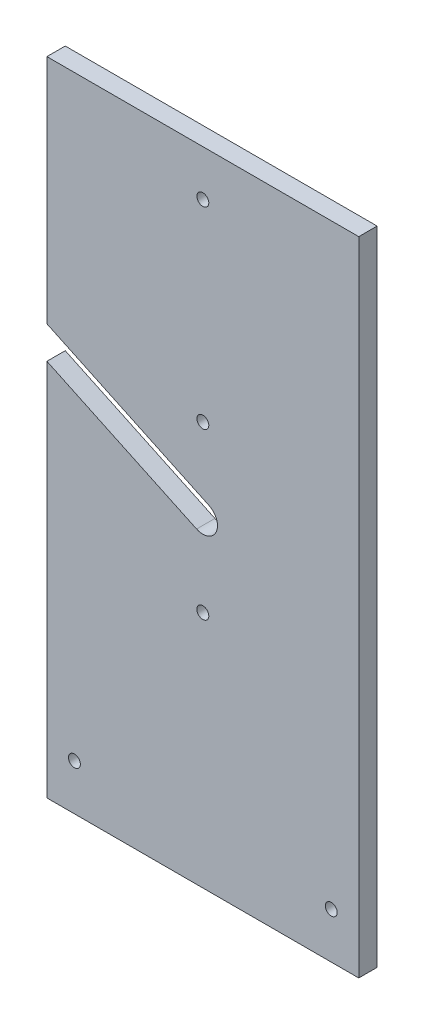
ISO-10303-21;
HEADER;
FILE_DESCRIPTION(('STEP AP214'),'2;1');
FILE_NAME('part.step','',(''),(''),'','','');
FILE_SCHEMA(('AUTOMOTIVE_DESIGN { 1 0 10303 214 1 1 1 1 }'));
ENDSEC;
DATA;
#1=APPLICATION_CONTEXT('core data for automotive mechanical design processes');
#2=APPLICATION_PROTOCOL_DEFINITION('international standard','automotive_design',2000,#1);
#3=PRODUCT_CONTEXT('',#1,'mechanical');
#4=PRODUCT('Part','Part','',(#3));
#5=PRODUCT_RELATED_PRODUCT_CATEGORY('part','',(#4));
#6=PRODUCT_DEFINITION_FORMATION('','',#4);
#7=PRODUCT_DEFINITION_CONTEXT('part definition',#1,'design');
#8=PRODUCT_DEFINITION('design','',#6,#7);
#9=PRODUCT_DEFINITION_SHAPE('','',#8);
#10=(LENGTH_UNIT() NAMED_UNIT(*) SI_UNIT(.MILLI.,.METRE.));
#11=(NAMED_UNIT(*) PLANE_ANGLE_UNIT() SI_UNIT($,.RADIAN.));
#12=(NAMED_UNIT(*) SI_UNIT($,.STERADIAN.) SOLID_ANGLE_UNIT());
#13=UNCERTAINTY_MEASURE_WITH_UNIT(LENGTH_MEASURE(1.E-05),#10,'distance_accuracy_value','');
#14=(GEOMETRIC_REPRESENTATION_CONTEXT(3) GLOBAL_UNCERTAINTY_ASSIGNED_CONTEXT((#13)) GLOBAL_UNIT_ASSIGNED_CONTEXT((#10,
#11,#12)) REPRESENTATION_CONTEXT('',''));
#15=CARTESIAN_POINT('',(0.,0.,0.));
#16=DIRECTION('',(0.,0.,1.));
#17=DIRECTION('',(1.,0.,0.));
#18=AXIS2_PLACEMENT_3D('',#15,#16,#17);
#19=CARTESIAN_POINT('',(85.,175.,10.));
#20=DIRECTION('',(0.,-1.,0.));
#21=DIRECTION('',(1.,0.,0.));
#22=AXIS2_PLACEMENT_3D('',#19,#20,#21);
#23=PLANE('',#22);
#24=DIRECTION('',(-1.,0.,0.));
#25=VECTOR('',#24,1.);
#26=CARTESIAN_POINT('',(85.,175.,0.));
#27=LINE('',#26,#25);
#28=CARTESIAN_POINT('',(85.,175.,0.));
#29=VERTEX_POINT('',#28);
#30=CARTESIAN_POINT('',(-85.,175.,0.));
#31=VERTEX_POINT('',#30);
#32=EDGE_CURVE('E142',#29,#31,#27,.T.);
#33=ORIENTED_EDGE('',*,*,#32,.T.);
#34=DIRECTION('',(0.,0.,-1.));
#35=VECTOR('',#34,1.);
#36=CARTESIAN_POINT('',(-85.,175.,10.));
#37=LINE('',#36,#35);
#38=CARTESIAN_POINT('',(-85.,175.,10.));
#39=VERTEX_POINT('',#38);
#40=EDGE_CURVE('E11',#39,#31,#37,.T.);
#41=ORIENTED_EDGE('',*,*,#40,.F.);
#42=DIRECTION('',(-1.,0.,0.));
#43=VECTOR('',#42,1.);
#44=CARTESIAN_POINT('',(85.,175.,10.));
#45=LINE('',#44,#43);
#46=CARTESIAN_POINT('',(85.,175.,10.));
#47=VERTEX_POINT('',#46);
#48=EDGE_CURVE('E170',#47,#39,#45,.T.);
#49=ORIENTED_EDGE('',*,*,#48,.F.);
#50=DIRECTION('',(0.,0.,-1.));
#51=VECTOR('',#50,1.);
#52=CARTESIAN_POINT('',(85.,175.,10.));
#53=LINE('',#52,#51);
#54=EDGE_CURVE('E56',#47,#29,#53,.T.);
#55=ORIENTED_EDGE('',*,*,#54,.T.);
#56=EDGE_LOOP('',(#33,#41,#49,#55));
#57=FACE_BOUND('',#56,.T.);
#58=ADVANCED_FACE('F39',(#57),#23,.F.);
#59=CARTESIAN_POINT('',(-85.,175.,10.));
#60=DIRECTION('',(1.,0.,0.));
#61=DIRECTION('',(0.,1.,0.));
#62=AXIS2_PLACEMENT_3D('',#59,#60,#61);
#63=PLANE('',#62);
#64=DIRECTION('',(0.,-1.,0.));
#65=VECTOR('',#64,1.);
#66=CARTESIAN_POINT('',(-85.,175.,0.));
#67=LINE('',#66,#65);
#68=CARTESIAN_POINT('',(-85.,48.8415502249675,0.));
#69=VERTEX_POINT('',#68);
#70=EDGE_CURVE('E145',#31,#69,#67,.T.);
#71=ORIENTED_EDGE('',*,*,#70,.T.);
#72=DIRECTION('',(0.,0.,-1.));
#73=VECTOR('',#72,1.);
#74=CARTESIAN_POINT('',(-85.,48.8415502249675,10.));
#75=LINE('',#74,#73);
#76=CARTESIAN_POINT('',(-85.,48.8415502249675,10.));
#77=VERTEX_POINT('',#76);
#78=EDGE_CURVE('E48',#77,#69,#75,.T.);
#79=ORIENTED_EDGE('',*,*,#78,.F.);
#80=DIRECTION('',(0.,-1.,0.));
#81=VECTOR('',#80,1.);
#82=CARTESIAN_POINT('',(-85.,175.,10.));
#83=LINE('',#82,#81);
#84=EDGE_CURVE('E94',#39,#77,#83,.T.);
#85=ORIENTED_EDGE('',*,*,#84,.F.);
#86=ORIENTED_EDGE('',*,*,#40,.T.);
#87=EDGE_LOOP('',(#71,#79,#85,#86));
#88=FACE_BOUND('',#87,.T.);
#89=ADVANCED_FACE('F189',(#88),#63,.F.);
#90=CARTESIAN_POINT('',(3.40637629063904,7.23854961760795,10.));
#91=DIRECTION('',(-0.42579703632988,-0.904818702200994,0.));
#92=DIRECTION('',(0.904818702200994,-0.42579703632988,0.));
#93=AXIS2_PLACEMENT_3D('',#90,#91,#92);
#94=PLANE('',#93);
#95=DIRECTION('',(-0.904818702200994,0.425797036329879,0.));
#96=VECTOR('',#95,1.);
#97=CARTESIAN_POINT('',(3.40637629063904,7.23854961760795,0.));
#98=LINE('',#97,#96);
#99=CARTESIAN_POINT('',(3.40637629063904,7.23854961760795,0.));
#100=VERTEX_POINT('',#99);
#101=EDGE_CURVE('E150',#100,#69,#98,.T.);
#102=ORIENTED_EDGE('',*,*,#101,.F.);
#103=DIRECTION('',(0.,0.,-1.));
#104=VECTOR('',#103,1.);
#105=CARTESIAN_POINT('',(3.40637629063904,7.23854961760795,10.));
#106=LINE('',#105,#104);
#107=CARTESIAN_POINT('',(3.40637629063904,7.23854961760795,10.));
#108=VERTEX_POINT('',#107);
#109=EDGE_CURVE('E180',#108,#100,#106,.T.);
#110=ORIENTED_EDGE('',*,*,#109,.F.);
#111=DIRECTION('',(-0.904818702200994,0.425797036329879,0.));
#112=VECTOR('',#111,1.);
#113=CARTESIAN_POINT('',(3.40637629063904,7.23854961760795,10.));
#114=LINE('',#113,#112);
#115=EDGE_CURVE('E188',#108,#77,#114,.T.);
#116=ORIENTED_EDGE('',*,*,#115,.T.);
#117=ORIENTED_EDGE('',*,*,#78,.T.);
#118=EDGE_LOOP('',(#102,#110,#116,#117));
#119=FACE_BOUND('',#118,.T.);
#120=ADVANCED_FACE('F186',(#119),#94,.T.);
#121=CARTESIAN_POINT('',(0.,0.,10.));
#122=DIRECTION('',(0.,0.,-1.));
#123=DIRECTION('',(-1.,0.,0.));
#124=AXIS2_PLACEMENT_3D('',#121,#122,#123);
#125=CYLINDRICAL_SURFACE('',#124,8.);
#126=CARTESIAN_POINT('',(0.,0.,0.));
#127=DIRECTION('',(0.,0.,1.));
#128=DIRECTION('',(1.,0.,0.));
#129=AXIS2_PLACEMENT_3D('',#126,#127,#128);
#130=CIRCLE('',#129,8.);
#131=CARTESIAN_POINT('',(-3.40637629063904,-7.23854961760796,0.));
#132=VERTEX_POINT('',#131);
#133=EDGE_CURVE('E154',#132,#100,#130,.T.);
#134=ORIENTED_EDGE('',*,*,#133,.F.);
#135=DIRECTION('',(0.,0.,-1.));
#136=VECTOR('',#135,1.);
#137=CARTESIAN_POINT('',(-3.40637629063904,-7.23854961760796,10.));
#138=LINE('',#137,#136);
#139=CARTESIAN_POINT('',(-3.40637629063904,-7.23854961760796,10.));
#140=VERTEX_POINT('',#139);
#141=EDGE_CURVE('E177',#140,#132,#138,.T.);
#142=ORIENTED_EDGE('',*,*,#141,.F.);
#143=CARTESIAN_POINT('',(0.,0.,10.));
#144=DIRECTION('',(0.,0.,1.));
#145=DIRECTION('',(1.,0.,0.));
#146=AXIS2_PLACEMENT_3D('',#143,#144,#145);
#147=CIRCLE('',#146,8.);
#148=EDGE_CURVE('E198',#140,#108,#147,.T.);
#149=ORIENTED_EDGE('',*,*,#148,.T.);
#150=ORIENTED_EDGE('',*,*,#109,.T.);
#151=EDGE_LOOP('',(#134,#142,#149,#150));
#152=FACE_BOUND('',#151,.T.);
#153=ADVANCED_FACE('F196',(#152),#125,.F.);
#154=CARTESIAN_POINT('',(-3.40637629063904,-7.23854961760796,10.));
#155=DIRECTION('',(-0.42579703632988,-0.904818702200994,0.));
#156=DIRECTION('',(0.904818702200994,-0.42579703632988,0.));
#157=AXIS2_PLACEMENT_3D('',#154,#155,#156);
#158=PLANE('',#157);
#159=DIRECTION('',(-0.904818702200994,0.42579703632988,0.));
#160=VECTOR('',#159,1.);
#161=CARTESIAN_POINT('',(-3.40637629063904,-7.23854961760796,0.));
#162=LINE('',#161,#160);
#163=CARTESIAN_POINT('',(-85.,31.1584497750325,0.));
#164=VERTEX_POINT('',#163);
#165=EDGE_CURVE('E158',#132,#164,#162,.T.);
#166=ORIENTED_EDGE('',*,*,#165,.T.);
#167=DIRECTION('',(0.,0.,-1.));
#168=VECTOR('',#167,1.);
#169=CARTESIAN_POINT('',(-85.,31.1584497750325,10.));
#170=LINE('',#169,#168);
#171=CARTESIAN_POINT('',(-85.,31.1584497750325,10.));
#172=VERTEX_POINT('',#171);
#173=EDGE_CURVE('E132',#172,#164,#170,.T.);
#174=ORIENTED_EDGE('',*,*,#173,.F.);
#175=DIRECTION('',(-0.904818702200994,0.42579703632988,0.));
#176=VECTOR('',#175,1.);
#177=CARTESIAN_POINT('',(-3.40637629063904,-7.23854961760796,10.));
#178=LINE('',#177,#176);
#179=EDGE_CURVE('E118',#140,#172,#178,.T.);
#180=ORIENTED_EDGE('',*,*,#179,.F.);
#181=ORIENTED_EDGE('',*,*,#141,.T.);
#182=EDGE_LOOP('',(#166,#174,#180,#181));
#183=FACE_BOUND('',#182,.T.);
#184=ADVANCED_FACE('F291',(#183),#158,.F.);
#185=CARTESIAN_POINT('',(-85.,31.1584497750325,10.));
#186=DIRECTION('',(1.,0.,0.));
#187=DIRECTION('',(0.,1.,0.));
#188=AXIS2_PLACEMENT_3D('',#185,#186,#187);
#189=PLANE('',#188);
#190=DIRECTION('',(0.,-1.,0.));
#191=VECTOR('',#190,1.);
#192=CARTESIAN_POINT('',(-85.,31.1584497750325,0.));
#193=LINE('',#192,#191);
#194=CARTESIAN_POINT('',(-85.,-175.,0.));
#195=VERTEX_POINT('',#194);
#196=EDGE_CURVE('E128',#164,#195,#193,.T.);
#197=ORIENTED_EDGE('',*,*,#196,.T.);
#198=DIRECTION('',(0.,0.,-1.));
#199=VECTOR('',#198,1.);
#200=CARTESIAN_POINT('',(-85.,-175.,10.));
#201=LINE('',#200,#199);
#202=CARTESIAN_POINT('',(-85.,-175.,10.));
#203=VERTEX_POINT('',#202);
#204=EDGE_CURVE('E125',#203,#195,#201,.T.);
#205=ORIENTED_EDGE('',*,*,#204,.F.);
#206=DIRECTION('',(0.,-1.,0.));
#207=VECTOR('',#206,1.);
#208=CARTESIAN_POINT('',(-85.,31.1584497750325,10.));
#209=LINE('',#208,#207);
#210=EDGE_CURVE('E110',#172,#203,#209,.T.);
#211=ORIENTED_EDGE('',*,*,#210,.F.);
#212=ORIENTED_EDGE('',*,*,#173,.T.);
#213=EDGE_LOOP('',(#197,#205,#211,#212));
#214=FACE_BOUND('',#213,.T.);
#215=ADVANCED_FACE('F126',(#214),#189,.F.);
#216=CARTESIAN_POINT('',(85.,-175.,10.));
#217=DIRECTION('',(0.,-1.,0.));
#218=DIRECTION('',(1.,0.,0.));
#219=AXIS2_PLACEMENT_3D('',#216,#217,#218);
#220=PLANE('',#219);
#221=DIRECTION('',(-1.,0.,0.));
#222=VECTOR('',#221,1.);
#223=CARTESIAN_POINT('',(85.,-175.,0.));
#224=LINE('',#223,#222);
#225=CARTESIAN_POINT('',(85.,-175.,0.));
#226=VERTEX_POINT('',#225);
#227=EDGE_CURVE('E163',#226,#195,#224,.T.);
#228=ORIENTED_EDGE('',*,*,#227,.F.);
#229=DIRECTION('',(0.,0.,-1.));
#230=VECTOR('',#229,1.);
#231=CARTESIAN_POINT('',(85.,-175.,10.));
#232=LINE('',#231,#230);
#233=CARTESIAN_POINT('',(85.,-175.,10.));
#234=VERTEX_POINT('',#233);
#235=EDGE_CURVE('E82',#234,#226,#232,.T.);
#236=ORIENTED_EDGE('',*,*,#235,.F.);
#237=DIRECTION('',(-1.,0.,0.));
#238=VECTOR('',#237,1.);
#239=CARTESIAN_POINT('',(85.,-175.,10.));
#240=LINE('',#239,#238);
#241=EDGE_CURVE('E115',#234,#203,#240,.T.);
#242=ORIENTED_EDGE('',*,*,#241,.T.);
#243=ORIENTED_EDGE('',*,*,#204,.T.);
#244=EDGE_LOOP('',(#228,#236,#242,#243));
#245=FACE_BOUND('',#244,.T.);
#246=ADVANCED_FACE('F134',(#245),#220,.T.);
#247=CARTESIAN_POINT('',(85.,175.,10.));
#248=DIRECTION('',(1.,0.,0.));
#249=DIRECTION('',(0.,1.,0.));
#250=AXIS2_PLACEMENT_3D('',#247,#248,#249);
#251=PLANE('',#250);
#252=DIRECTION('',(0.,-1.,0.));
#253=VECTOR('',#252,1.);
#254=CARTESIAN_POINT('',(85.,175.,0.));
#255=LINE('',#254,#253);
#256=EDGE_CURVE('E166',#29,#226,#255,.T.);
#257=ORIENTED_EDGE('',*,*,#256,.F.);
#258=ORIENTED_EDGE('',*,*,#54,.F.);
#259=DIRECTION('',(0.,-1.,0.));
#260=VECTOR('',#259,1.);
#261=CARTESIAN_POINT('',(85.,175.,10.));
#262=LINE('',#261,#260);
#263=EDGE_CURVE('E136',#47,#234,#262,.T.);
#264=ORIENTED_EDGE('',*,*,#263,.T.);
#265=ORIENTED_EDGE('',*,*,#235,.T.);
#266=EDGE_LOOP('',(#257,#258,#264,#265));
#267=FACE_BOUND('',#266,.T.);
#268=ADVANCED_FACE('F253',(#267),#251,.T.);
#269=CARTESIAN_POINT('',(0.,0.,10.));
#270=DIRECTION('',(0.,0.,1.));
#271=DIRECTION('',(1.,0.,0.));
#272=AXIS2_PLACEMENT_3D('',#269,#270,#271);
#273=PLANE('',#272);
#274=CARTESIAN_POINT('',(0.,150.,10.));
#275=DIRECTION('',(0.,0.,1.));
#276=DIRECTION('',(1.,0.,0.));
#277=AXIS2_PLACEMENT_3D('',#274,#275,#276);
#278=CIRCLE('',#277,3.25);
#279=CARTESIAN_POINT('',(3.24999999999998,150.,10.));
#280=VERTEX_POINT('',#279);
#281=EDGE_CURVE('E244',#280,#280,#278,.T.);
#282=ORIENTED_EDGE('',*,*,#281,.F.);
#283=EDGE_LOOP('',(#282));
#284=FACE_BOUND('',#283,.T.);
#285=CARTESIAN_POINT('',(-70.,-150.,10.));
#286=DIRECTION('',(0.,0.,1.));
#287=DIRECTION('',(1.,0.,0.));
#288=AXIS2_PLACEMENT_3D('',#285,#286,#287);
#289=CIRCLE('',#288,3.25);
#290=CARTESIAN_POINT('',(-66.75,-150.,10.));
#291=VERTEX_POINT('',#290);
#292=EDGE_CURVE('E236',#291,#291,#289,.T.);
#293=ORIENTED_EDGE('',*,*,#292,.F.);
#294=EDGE_LOOP('',(#293));
#295=FACE_BOUND('',#294,.T.);
#296=CARTESIAN_POINT('',(70.,-150.,10.));
#297=DIRECTION('',(0.,0.,1.));
#298=DIRECTION('',(1.,0.,0.));
#299=AXIS2_PLACEMENT_3D('',#296,#297,#298);
#300=CIRCLE('',#299,3.25);
#301=CARTESIAN_POINT('',(73.25,-150.,10.));
#302=VERTEX_POINT('',#301);
#303=EDGE_CURVE('E228',#302,#302,#300,.T.);
#304=ORIENTED_EDGE('',*,*,#303,.F.);
#305=EDGE_LOOP('',(#304));
#306=FACE_BOUND('',#305,.T.);
#307=CARTESIAN_POINT('',(0.,45.,10.));
#308=DIRECTION('',(0.,0.,1.));
#309=DIRECTION('',(1.,0.,0.));
#310=AXIS2_PLACEMENT_3D('',#307,#308,#309);
#311=CIRCLE('',#310,3.25);
#312=CARTESIAN_POINT('',(3.25,45.,10.));
#313=VERTEX_POINT('',#312);
#314=EDGE_CURVE('E220',#313,#313,#311,.T.);
#315=ORIENTED_EDGE('',*,*,#314,.F.);
#316=EDGE_LOOP('',(#315));
#317=FACE_BOUND('',#316,.T.);
#318=CARTESIAN_POINT('',(0.,-45.,10.));
#319=DIRECTION('',(0.,0.,1.));
#320=DIRECTION('',(1.,0.,0.));
#321=AXIS2_PLACEMENT_3D('',#318,#319,#320);
#322=CIRCLE('',#321,3.25);
#323=CARTESIAN_POINT('',(3.25,-45.,10.));
#324=VERTEX_POINT('',#323);
#325=EDGE_CURVE('E212',#324,#324,#322,.T.);
#326=ORIENTED_EDGE('',*,*,#325,.F.);
#327=EDGE_LOOP('',(#326));
#328=FACE_BOUND('',#327,.T.);
#329=ORIENTED_EDGE('',*,*,#48,.T.);
#330=ORIENTED_EDGE('',*,*,#84,.T.);
#331=ORIENTED_EDGE('',*,*,#115,.F.);
#332=ORIENTED_EDGE('',*,*,#148,.F.);
#333=ORIENTED_EDGE('',*,*,#179,.T.);
#334=ORIENTED_EDGE('',*,*,#210,.T.);
#335=ORIENTED_EDGE('',*,*,#241,.F.);
#336=ORIENTED_EDGE('',*,*,#263,.F.);
#337=EDGE_LOOP('',(#329,#330,#331,#332,#333,#334,#335,#336));
#338=FACE_BOUND('',#337,.T.);
#339=ADVANCED_FACE('F112',(#284,#295,#306,#317,#328,#338),#273,.T.);
#340=CARTESIAN_POINT('',(0.,0.,0.));
#341=DIRECTION('',(0.,0.,1.));
#342=DIRECTION('',(1.,0.,0.));
#343=AXIS2_PLACEMENT_3D('',#340,#341,#342);
#344=PLANE('',#343);
#345=CARTESIAN_POINT('',(0.,150.,0.));
#346=DIRECTION('',(0.,0.,1.));
#347=DIRECTION('',(1.,0.,0.));
#348=AXIS2_PLACEMENT_3D('',#345,#346,#347);
#349=CIRCLE('',#348,3.25);
#350=CARTESIAN_POINT('',(3.24999999999998,150.,0.));
#351=VERTEX_POINT('',#350);
#352=EDGE_CURVE('E240',#351,#351,#349,.T.);
#353=ORIENTED_EDGE('',*,*,#352,.T.);
#354=EDGE_LOOP('',(#353));
#355=FACE_BOUND('',#354,.T.);
#356=CARTESIAN_POINT('',(-70.,-150.,0.));
#357=DIRECTION('',(0.,0.,1.));
#358=DIRECTION('',(1.,0.,0.));
#359=AXIS2_PLACEMENT_3D('',#356,#357,#358);
#360=CIRCLE('',#359,3.25);
#361=CARTESIAN_POINT('',(-66.75,-150.,0.));
#362=VERTEX_POINT('',#361);
#363=EDGE_CURVE('E232',#362,#362,#360,.T.);
#364=ORIENTED_EDGE('',*,*,#363,.T.);
#365=EDGE_LOOP('',(#364));
#366=FACE_BOUND('',#365,.T.);
#367=CARTESIAN_POINT('',(70.,-150.,0.));
#368=DIRECTION('',(0.,0.,1.));
#369=DIRECTION('',(1.,0.,0.));
#370=AXIS2_PLACEMENT_3D('',#367,#368,#369);
#371=CIRCLE('',#370,3.25);
#372=CARTESIAN_POINT('',(73.25,-150.,0.));
#373=VERTEX_POINT('',#372);
#374=EDGE_CURVE('E224',#373,#373,#371,.T.);
#375=ORIENTED_EDGE('',*,*,#374,.T.);
#376=EDGE_LOOP('',(#375));
#377=FACE_BOUND('',#376,.T.);
#378=CARTESIAN_POINT('',(0.,45.,0.));
#379=DIRECTION('',(0.,0.,1.));
#380=DIRECTION('',(1.,0.,0.));
#381=AXIS2_PLACEMENT_3D('',#378,#379,#380);
#382=CIRCLE('',#381,3.25);
#383=CARTESIAN_POINT('',(3.25,45.,0.));
#384=VERTEX_POINT('',#383);
#385=EDGE_CURVE('E216',#384,#384,#382,.T.);
#386=ORIENTED_EDGE('',*,*,#385,.T.);
#387=EDGE_LOOP('',(#386));
#388=FACE_BOUND('',#387,.T.);
#389=CARTESIAN_POINT('',(0.,-45.,0.));
#390=DIRECTION('',(0.,0.,1.));
#391=DIRECTION('',(1.,0.,0.));
#392=AXIS2_PLACEMENT_3D('',#389,#390,#391);
#393=CIRCLE('',#392,3.25);
#394=CARTESIAN_POINT('',(3.25,-45.,0.));
#395=VERTEX_POINT('',#394);
#396=EDGE_CURVE('E146',#395,#395,#393,.T.);
#397=ORIENTED_EDGE('',*,*,#396,.T.);
#398=EDGE_LOOP('',(#397));
#399=FACE_BOUND('',#398,.T.);
#400=ORIENTED_EDGE('',*,*,#32,.F.);
#401=ORIENTED_EDGE('',*,*,#256,.T.);
#402=ORIENTED_EDGE('',*,*,#227,.T.);
#403=ORIENTED_EDGE('',*,*,#196,.F.);
#404=ORIENTED_EDGE('',*,*,#165,.F.);
#405=ORIENTED_EDGE('',*,*,#133,.T.);
#406=ORIENTED_EDGE('',*,*,#101,.T.);
#407=ORIENTED_EDGE('',*,*,#70,.F.);
#408=EDGE_LOOP('',(#400,#401,#402,#403,#404,#405,#406,#407));
#409=FACE_BOUND('',#408,.T.);
#410=ADVANCED_FACE('F192',(#355,#366,#377,#388,#399,#409),#344,.F.);
#411=CARTESIAN_POINT('',(0.,-45.,10.));
#412=DIRECTION('',(0.,0.,1.));
#413=DIRECTION('',(1.,0.,0.));
#414=AXIS2_PLACEMENT_3D('',#411,#412,#413);
#415=CYLINDRICAL_SURFACE('',#414,3.25);
#416=ORIENTED_EDGE('',*,*,#396,.F.);
#417=EDGE_LOOP('',(#416));
#418=FACE_BOUND('',#417,.T.);
#419=ORIENTED_EDGE('',*,*,#325,.T.);
#420=EDGE_LOOP('',(#419));
#421=FACE_BOUND('',#420,.T.);
#422=ADVANCED_FACE('F263',(#418,#421),#415,.F.);
#423=CARTESIAN_POINT('',(0.,45.,10.));
#424=DIRECTION('',(0.,0.,1.));
#425=DIRECTION('',(1.,0.,0.));
#426=AXIS2_PLACEMENT_3D('',#423,#424,#425);
#427=CYLINDRICAL_SURFACE('',#426,3.25);
#428=ORIENTED_EDGE('',*,*,#385,.F.);
#429=EDGE_LOOP('',(#428));
#430=FACE_BOUND('',#429,.T.);
#431=ORIENTED_EDGE('',*,*,#314,.T.);
#432=EDGE_LOOP('',(#431));
#433=FACE_BOUND('',#432,.T.);
#434=ADVANCED_FACE('F265',(#430,#433),#427,.F.);
#435=CARTESIAN_POINT('',(70.,-150.,10.));
#436=DIRECTION('',(0.,0.,1.));
#437=DIRECTION('',(1.,0.,0.));
#438=AXIS2_PLACEMENT_3D('',#435,#436,#437);
#439=CYLINDRICAL_SURFACE('',#438,3.25);
#440=ORIENTED_EDGE('',*,*,#374,.F.);
#441=EDGE_LOOP('',(#440));
#442=FACE_BOUND('',#441,.T.);
#443=ORIENTED_EDGE('',*,*,#303,.T.);
#444=EDGE_LOOP('',(#443));
#445=FACE_BOUND('',#444,.T.);
#446=ADVANCED_FACE('F272',(#442,#445),#439,.F.);
#447=CARTESIAN_POINT('',(-70.,-150.,10.));
#448=DIRECTION('',(0.,0.,1.));
#449=DIRECTION('',(1.,0.,0.));
#450=AXIS2_PLACEMENT_3D('',#447,#448,#449);
#451=CYLINDRICAL_SURFACE('',#450,3.25);
#452=ORIENTED_EDGE('',*,*,#363,.F.);
#453=EDGE_LOOP('',(#452));
#454=FACE_BOUND('',#453,.T.);
#455=ORIENTED_EDGE('',*,*,#292,.T.);
#456=EDGE_LOOP('',(#455));
#457=FACE_BOUND('',#456,.T.);
#458=ADVANCED_FACE('F353',(#454,#457),#451,.F.);
#459=CARTESIAN_POINT('',(0.,150.,10.));
#460=DIRECTION('',(0.,0.,1.));
#461=DIRECTION('',(1.,0.,0.));
#462=AXIS2_PLACEMENT_3D('',#459,#460,#461);
#463=CYLINDRICAL_SURFACE('',#462,3.25);
#464=ORIENTED_EDGE('',*,*,#352,.F.);
#465=EDGE_LOOP('',(#464));
#466=FACE_BOUND('',#465,.T.);
#467=ORIENTED_EDGE('',*,*,#281,.T.);
#468=EDGE_LOOP('',(#467));
#469=FACE_BOUND('',#468,.T.);
#470=ADVANCED_FACE('F249',(#466,#469),#463,.F.);
#471=CLOSED_SHELL('',(#58,#89,#120,#153,#184,#215,#246,#268,#339,#410,#422,#434,#446,#458,#470));
#472=MANIFOLD_SOLID_BREP('B2',#471);
#473=ADVANCED_BREP_SHAPE_REPRESENTATION('',(#18,#472),#14);
#474=SHAPE_DEFINITION_REPRESENTATION(#9,#473);
ENDSEC;
END-ISO-10303-21;
